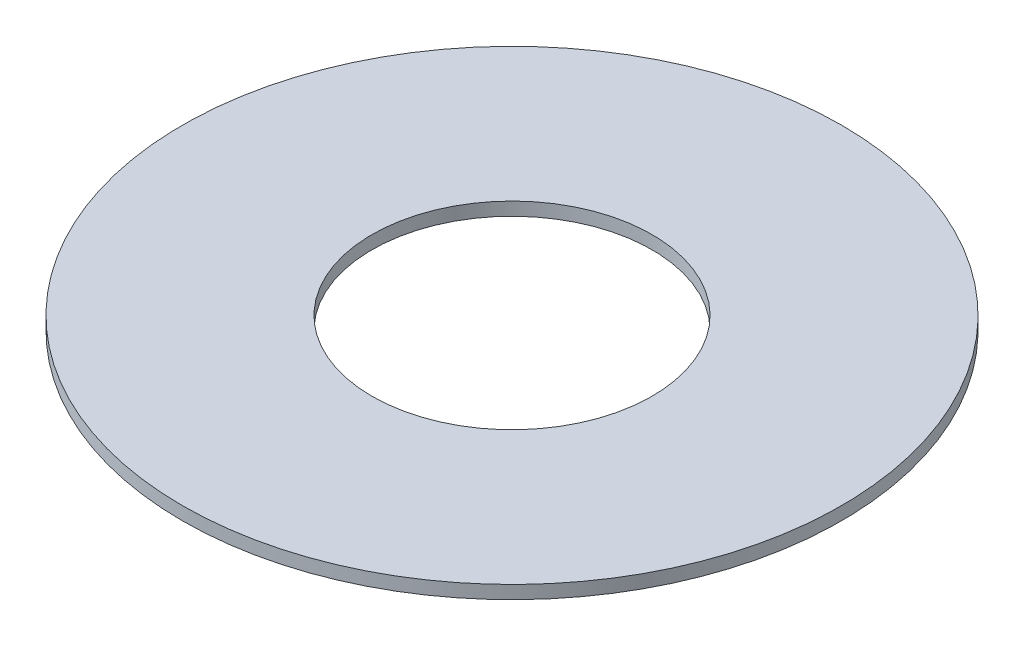
ISO-10303-21;
HEADER;
FILE_DESCRIPTION(('STEP AP214'),'2;1');
FILE_NAME('part.step','',(''),(''),'','','');
FILE_SCHEMA(('AUTOMOTIVE_DESIGN { 1 0 10303 214 1 1 1 1 }'));
ENDSEC;
DATA;
#1=APPLICATION_CONTEXT('core data for automotive mechanical design processes');
#2=APPLICATION_PROTOCOL_DEFINITION('international standard','automotive_design',2000,#1);
#3=PRODUCT_CONTEXT('',#1,'mechanical');
#4=PRODUCT('Part','Part','',(#3));
#5=PRODUCT_RELATED_PRODUCT_CATEGORY('part','',(#4));
#6=PRODUCT_DEFINITION_FORMATION('','',#4);
#7=PRODUCT_DEFINITION_CONTEXT('part definition',#1,'design');
#8=PRODUCT_DEFINITION('design','',#6,#7);
#9=PRODUCT_DEFINITION_SHAPE('','',#8);
#10=(LENGTH_UNIT() NAMED_UNIT(*) SI_UNIT(.MILLI.,.METRE.));
#11=(NAMED_UNIT(*) PLANE_ANGLE_UNIT() SI_UNIT($,.RADIAN.));
#12=(NAMED_UNIT(*) SI_UNIT($,.STERADIAN.) SOLID_ANGLE_UNIT());
#13=UNCERTAINTY_MEASURE_WITH_UNIT(LENGTH_MEASURE(1.E-05),#10,'distance_accuracy_value','');
#14=(GEOMETRIC_REPRESENTATION_CONTEXT(3) GLOBAL_UNCERTAINTY_ASSIGNED_CONTEXT((#13)) GLOBAL_UNIT_ASSIGNED_CONTEXT((#10,
#11,#12)) REPRESENTATION_CONTEXT('',''));
#15=CARTESIAN_POINT('',(0.,0.,0.));
#16=DIRECTION('',(0.,0.,1.));
#17=DIRECTION('',(1.,0.,0.));
#18=AXIS2_PLACEMENT_3D('',#15,#16,#17);
#19=CARTESIAN_POINT('',(0.,4.,0.));
#20=DIRECTION('',(0.,-1.,0.));
#21=DIRECTION('',(0.,0.,-1.));
#22=AXIS2_PLACEMENT_3D('',#19,#20,#21);
#23=CYLINDRICAL_SURFACE('',#22,100.);
#24=CARTESIAN_POINT('',(0.,4.,0.));
#25=DIRECTION('',(0.,1.,0.));
#26=DIRECTION('',(0.,0.,1.));
#27=AXIS2_PLACEMENT_3D('',#24,#25,#26);
#28=CIRCLE('',#27,100.);
#29=CARTESIAN_POINT('',(0.,4.,100.));
#30=VERTEX_POINT('',#29);
#31=EDGE_CURVE('E10',#30,#30,#28,.T.);
#32=ORIENTED_EDGE('',*,*,#31,.F.);
#33=EDGE_LOOP('',(#32));
#34=FACE_BOUND('',#33,.T.);
#35=CARTESIAN_POINT('',(0.,0.,0.));
#36=DIRECTION('',(0.,1.,0.));
#37=DIRECTION('',(0.,0.,1.));
#38=AXIS2_PLACEMENT_3D('',#35,#36,#37);
#39=CIRCLE('',#38,100.);
#40=CARTESIAN_POINT('',(0.,0.,100.));
#41=VERTEX_POINT('',#40);
#42=EDGE_CURVE('E37',#41,#41,#39,.T.);
#43=ORIENTED_EDGE('',*,*,#42,.T.);
#44=EDGE_LOOP('',(#43));
#45=FACE_BOUND('',#44,.T.);
#46=ADVANCED_FACE('F40',(#34,#45),#23,.T.);
#47=CARTESIAN_POINT('',(0.,4.,0.));
#48=DIRECTION('',(0.,1.,0.));
#49=DIRECTION('',(0.,0.,1.));
#50=AXIS2_PLACEMENT_3D('',#47,#48,#49);
#51=PLANE('',#50);
#52=CARTESIAN_POINT('',(0.,4.,0.));
#53=DIRECTION('',(0.,1.,0.));
#54=DIRECTION('',(0.,0.,1.));
#55=AXIS2_PLACEMENT_3D('',#52,#53,#54);
#56=CIRCLE('',#55,42.5);
#57=CARTESIAN_POINT('',(0.,4.,42.5));
#58=VERTEX_POINT('',#57);
#59=EDGE_CURVE('E50',#58,#58,#56,.T.);
#60=ORIENTED_EDGE('',*,*,#59,.F.);
#61=EDGE_LOOP('',(#60));
#62=FACE_BOUND('',#61,.T.);
#63=ORIENTED_EDGE('',*,*,#31,.T.);
#64=EDGE_LOOP('',(#63));
#65=FACE_BOUND('',#64,.T.);
#66=ADVANCED_FACE('F59',(#62,#65),#51,.T.);
#67=CARTESIAN_POINT('',(0.,0.,0.));
#68=DIRECTION('',(0.,1.,0.));
#69=DIRECTION('',(0.,0.,1.));
#70=AXIS2_PLACEMENT_3D('',#67,#68,#69);
#71=PLANE('',#70);
#72=CARTESIAN_POINT('',(0.,0.,0.));
#73=DIRECTION('',(0.,1.,0.));
#74=DIRECTION('',(0.,0.,1.));
#75=AXIS2_PLACEMENT_3D('',#72,#73,#74);
#76=CIRCLE('',#75,42.5);
#77=CARTESIAN_POINT('',(0.,0.,42.5));
#78=VERTEX_POINT('',#77);
#79=EDGE_CURVE('E47',#78,#78,#76,.T.);
#80=ORIENTED_EDGE('',*,*,#79,.T.);
#81=EDGE_LOOP('',(#80));
#82=FACE_BOUND('',#81,.T.);
#83=ORIENTED_EDGE('',*,*,#42,.F.);
#84=EDGE_LOOP('',(#83));
#85=FACE_BOUND('',#84,.T.);
#86=ADVANCED_FACE('F58',(#82,#85),#71,.F.);
#87=CARTESIAN_POINT('',(0.,4.,0.));
#88=DIRECTION('',(0.,-1.,0.));
#89=DIRECTION('',(0.,0.,-1.));
#90=AXIS2_PLACEMENT_3D('',#87,#88,#89);
#91=CYLINDRICAL_SURFACE('',#90,42.5);
#92=ORIENTED_EDGE('',*,*,#59,.T.);
#93=EDGE_LOOP('',(#92));
#94=FACE_BOUND('',#93,.T.);
#95=ORIENTED_EDGE('',*,*,#79,.F.);
#96=EDGE_LOOP('',(#95));
#97=FACE_BOUND('',#96,.T.);
#98=ADVANCED_FACE('F54',(#94,#97),#91,.F.);
#99=CLOSED_SHELL('',(#46,#66,#86,#98));
#100=MANIFOLD_SOLID_BREP('B2',#99);
#101=ADVANCED_BREP_SHAPE_REPRESENTATION('',(#18,#100),#14);
#102=SHAPE_DEFINITION_REPRESENTATION(#9,#101);
ENDSEC;
END-ISO-10303-21;
